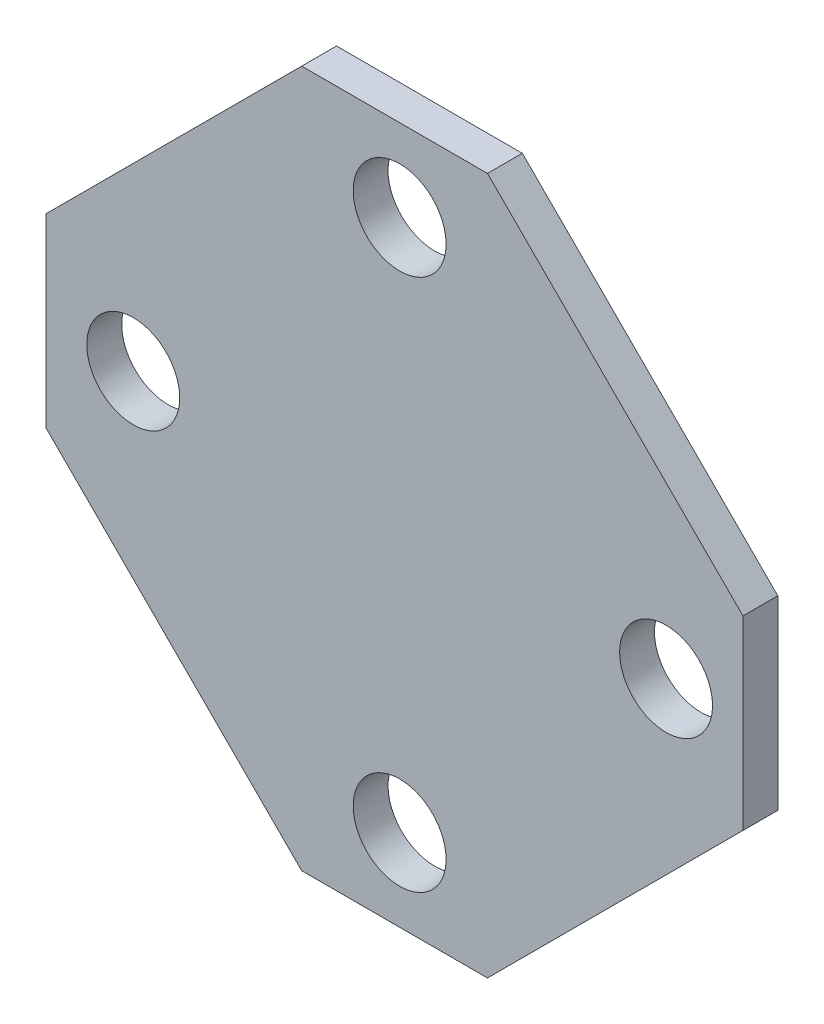
ISO-10303-21;
HEADER;
FILE_DESCRIPTION(('STEP AP214'),'2;1');
FILE_NAME('part.step','',(''),(''),'','','');
FILE_SCHEMA(('AUTOMOTIVE_DESIGN { 1 0 10303 214 1 1 1 1 }'));
ENDSEC;
DATA;
#1=APPLICATION_CONTEXT('core data for automotive mechanical design processes');
#2=APPLICATION_PROTOCOL_DEFINITION('international standard','automotive_design',2000,#1);
#3=PRODUCT_CONTEXT('',#1,'mechanical');
#4=PRODUCT('Part','Part','',(#3));
#5=PRODUCT_RELATED_PRODUCT_CATEGORY('part','',(#4));
#6=PRODUCT_DEFINITION_FORMATION('','',#4);
#7=PRODUCT_DEFINITION_CONTEXT('part definition',#1,'design');
#8=PRODUCT_DEFINITION('design','',#6,#7);
#9=PRODUCT_DEFINITION_SHAPE('','',#8);
#10=(LENGTH_UNIT() NAMED_UNIT(*) SI_UNIT(.MILLI.,.METRE.));
#11=(NAMED_UNIT(*) PLANE_ANGLE_UNIT() SI_UNIT($,.RADIAN.));
#12=(NAMED_UNIT(*) SI_UNIT($,.STERADIAN.) SOLID_ANGLE_UNIT());
#13=UNCERTAINTY_MEASURE_WITH_UNIT(LENGTH_MEASURE(1.E-05),#10,'distance_accuracy_value','');
#14=(GEOMETRIC_REPRESENTATION_CONTEXT(3) GLOBAL_UNCERTAINTY_ASSIGNED_CONTEXT((#13)) GLOBAL_UNIT_ASSIGNED_CONTEXT((#10,
#11,#12)) REPRESENTATION_CONTEXT('',''));
#15=CARTESIAN_POINT('',(0.,0.,0.));
#16=DIRECTION('',(0.,0.,1.));
#17=DIRECTION('',(1.,0.,0.));
#18=AXIS2_PLACEMENT_3D('',#15,#16,#17);
#19=CARTESIAN_POINT('',(8.00000000000001,30.,3.));
#20=DIRECTION('',(0.,-1.,0.));
#21=DIRECTION('',(0.,0.,-1.));
#22=AXIS2_PLACEMENT_3D('',#19,#20,#21);
#23=PLANE('',#22);
#24=DIRECTION('',(-1.,0.,0.));
#25=VECTOR('',#24,1.);
#26=CARTESIAN_POINT('',(8.00000000000001,30.,0.));
#27=LINE('',#26,#25);
#28=CARTESIAN_POINT('',(8.00000000000001,30.,0.));
#29=VERTEX_POINT('',#28);
#30=CARTESIAN_POINT('',(-7.99999999999999,30.,0.));
#31=VERTEX_POINT('',#30);
#32=EDGE_CURVE('E134',#29,#31,#27,.T.);
#33=ORIENTED_EDGE('',*,*,#32,.T.);
#34=DIRECTION('',(0.,0.,-1.));
#35=VECTOR('',#34,1.);
#36=CARTESIAN_POINT('',(-7.99999999999999,30.,3.));
#37=LINE('',#36,#35);
#38=CARTESIAN_POINT('',(-7.99999999999999,30.,3.));
#39=VERTEX_POINT('',#38);
#40=EDGE_CURVE('E11',#39,#31,#37,.T.);
#41=ORIENTED_EDGE('',*,*,#40,.F.);
#42=DIRECTION('',(-1.,0.,0.));
#43=VECTOR('',#42,1.);
#44=CARTESIAN_POINT('',(8.00000000000001,30.,3.));
#45=LINE('',#44,#43);
#46=CARTESIAN_POINT('',(8.00000000000001,30.,3.));
#47=VERTEX_POINT('',#46);
#48=EDGE_CURVE('E153',#47,#39,#45,.T.);
#49=ORIENTED_EDGE('',*,*,#48,.F.);
#50=DIRECTION('',(0.,0.,-1.));
#51=VECTOR('',#50,1.);
#52=CARTESIAN_POINT('',(8.00000000000001,30.,3.));
#53=LINE('',#52,#51);
#54=EDGE_CURVE('E130',#47,#29,#53,.T.);
#55=ORIENTED_EDGE('',*,*,#54,.T.);
#56=EDGE_LOOP('',(#33,#41,#49,#55));
#57=FACE_BOUND('',#56,.T.);
#58=ADVANCED_FACE('F38',(#57),#23,.F.);
#59=CARTESIAN_POINT('',(-7.99999999999999,30.,3.));
#60=DIRECTION('',(0.707106781186548,-0.707106781186547,0.));
#61=DIRECTION('',(0.707106781186547,0.707106781186548,0.));
#62=AXIS2_PLACEMENT_3D('',#59,#60,#61);
#63=PLANE('',#62);
#64=DIRECTION('',(-0.707106781186547,-0.707106781186548,0.));
#65=VECTOR('',#64,1.);
#66=CARTESIAN_POINT('',(-7.99999999999999,30.,0.));
#67=LINE('',#66,#65);
#68=CARTESIAN_POINT('',(-30.,7.99999999999999,0.));
#69=VERTEX_POINT('',#68);
#70=EDGE_CURVE('E137',#31,#69,#67,.T.);
#71=ORIENTED_EDGE('',*,*,#70,.T.);
#72=DIRECTION('',(0.,0.,-1.));
#73=VECTOR('',#72,1.);
#74=CARTESIAN_POINT('',(-30.,7.99999999999999,3.));
#75=LINE('',#74,#73);
#76=CARTESIAN_POINT('',(-30.,7.99999999999999,3.));
#77=VERTEX_POINT('',#76);
#78=EDGE_CURVE('E46',#77,#69,#75,.T.);
#79=ORIENTED_EDGE('',*,*,#78,.F.);
#80=DIRECTION('',(-0.707106781186547,-0.707106781186548,0.));
#81=VECTOR('',#80,1.);
#82=CARTESIAN_POINT('',(-7.99999999999999,30.,3.));
#83=LINE('',#82,#81);
#84=EDGE_CURVE('E97',#39,#77,#83,.T.);
#85=ORIENTED_EDGE('',*,*,#84,.F.);
#86=ORIENTED_EDGE('',*,*,#40,.T.);
#87=EDGE_LOOP('',(#71,#79,#85,#86));
#88=FACE_BOUND('',#87,.T.);
#89=ADVANCED_FACE('F166',(#88),#63,.F.);
#90=CARTESIAN_POINT('',(-30.,-8.00000000000001,3.));
#91=DIRECTION('',(-1.,0.,0.));
#92=DIRECTION('',(0.,0.,1.));
#93=AXIS2_PLACEMENT_3D('',#90,#91,#92);
#94=PLANE('',#93);
#95=DIRECTION('',(0.,1.,0.));
#96=VECTOR('',#95,1.);
#97=CARTESIAN_POINT('',(-30.,-8.00000000000001,0.));
#98=LINE('',#97,#96);
#99=CARTESIAN_POINT('',(-30.,-8.00000000000001,0.));
#100=VERTEX_POINT('',#99);
#101=EDGE_CURVE('E141',#100,#69,#98,.T.);
#102=ORIENTED_EDGE('',*,*,#101,.F.);
#103=DIRECTION('',(0.,0.,-1.));
#104=VECTOR('',#103,1.);
#105=CARTESIAN_POINT('',(-30.,-8.00000000000001,3.));
#106=LINE('',#105,#104);
#107=CARTESIAN_POINT('',(-30.,-8.00000000000001,3.));
#108=VERTEX_POINT('',#107);
#109=EDGE_CURVE('E159',#108,#100,#106,.T.);
#110=ORIENTED_EDGE('',*,*,#109,.F.);
#111=DIRECTION('',(0.,1.,0.));
#112=VECTOR('',#111,1.);
#113=CARTESIAN_POINT('',(-30.,-8.00000000000001,3.));
#114=LINE('',#113,#112);
#115=EDGE_CURVE('E165',#108,#77,#114,.T.);
#116=ORIENTED_EDGE('',*,*,#115,.T.);
#117=ORIENTED_EDGE('',*,*,#78,.T.);
#118=EDGE_LOOP('',(#102,#110,#116,#117));
#119=FACE_BOUND('',#118,.T.);
#120=ADVANCED_FACE('F163',(#119),#94,.T.);
#121=CARTESIAN_POINT('',(-7.99999999999999,-30.,3.));
#122=DIRECTION('',(-0.707106781186547,-0.707106781186548,0.));
#123=DIRECTION('',(0.707106781186548,-0.707106781186547,0.));
#124=AXIS2_PLACEMENT_3D('',#121,#122,#123);
#125=PLANE('',#124);
#126=DIRECTION('',(-0.707106781186548,0.707106781186547,0.));
#127=VECTOR('',#126,1.);
#128=CARTESIAN_POINT('',(-7.99999999999999,-30.,0.));
#129=LINE('',#128,#127);
#130=CARTESIAN_POINT('',(-7.99999999999999,-30.,0.));
#131=VERTEX_POINT('',#130);
#132=EDGE_CURVE('E144',#131,#100,#129,.T.);
#133=ORIENTED_EDGE('',*,*,#132,.F.);
#134=DIRECTION('',(0.,0.,-1.));
#135=VECTOR('',#134,1.);
#136=CARTESIAN_POINT('',(-7.99999999999999,-30.,3.));
#137=LINE('',#136,#135);
#138=CARTESIAN_POINT('',(-7.99999999999999,-30.,3.));
#139=VERTEX_POINT('',#138);
#140=EDGE_CURVE('E157',#139,#131,#137,.T.);
#141=ORIENTED_EDGE('',*,*,#140,.F.);
#142=DIRECTION('',(-0.707106781186548,0.707106781186547,0.));
#143=VECTOR('',#142,1.);
#144=CARTESIAN_POINT('',(-7.99999999999999,-30.,3.));
#145=LINE('',#144,#143);
#146=EDGE_CURVE('E176',#139,#108,#145,.T.);
#147=ORIENTED_EDGE('',*,*,#146,.T.);
#148=ORIENTED_EDGE('',*,*,#109,.T.);
#149=EDGE_LOOP('',(#133,#141,#147,#148));
#150=FACE_BOUND('',#149,.T.);
#151=ADVANCED_FACE('F174',(#150),#125,.T.);
#152=CARTESIAN_POINT('',(8.00000000000001,-30.,3.));
#153=DIRECTION('',(0.,-1.,0.));
#154=DIRECTION('',(0.,0.,-1.));
#155=AXIS2_PLACEMENT_3D('',#152,#153,#154);
#156=PLANE('',#155);
#157=DIRECTION('',(-1.,0.,0.));
#158=VECTOR('',#157,1.);
#159=CARTESIAN_POINT('',(8.00000000000001,-30.,0.));
#160=LINE('',#159,#158);
#161=CARTESIAN_POINT('',(8.00000000000001,-30.,0.));
#162=VERTEX_POINT('',#161);
#163=EDGE_CURVE('E147',#162,#131,#160,.T.);
#164=ORIENTED_EDGE('',*,*,#163,.F.);
#165=DIRECTION('',(0.,0.,-1.));
#166=VECTOR('',#165,1.);
#167=CARTESIAN_POINT('',(8.00000000000001,-30.,3.));
#168=LINE('',#167,#166);
#169=CARTESIAN_POINT('',(8.00000000000001,-30.,3.));
#170=VERTEX_POINT('',#169);
#171=EDGE_CURVE('E125',#170,#162,#168,.T.);
#172=ORIENTED_EDGE('',*,*,#171,.F.);
#173=DIRECTION('',(-1.,0.,0.));
#174=VECTOR('',#173,1.);
#175=CARTESIAN_POINT('',(8.00000000000001,-30.,3.));
#176=LINE('',#175,#174);
#177=EDGE_CURVE('E118',#170,#139,#176,.T.);
#178=ORIENTED_EDGE('',*,*,#177,.T.);
#179=ORIENTED_EDGE('',*,*,#140,.T.);
#180=EDGE_LOOP('',(#164,#172,#178,#179));
#181=FACE_BOUND('',#180,.T.);
#182=ADVANCED_FACE('F182',(#181),#156,.T.);
#183=CARTESIAN_POINT('',(8.00000000000001,-30.,3.));
#184=DIRECTION('',(-0.707106781186548,0.707106781186547,0.));
#185=DIRECTION('',(-0.707106781186547,-0.707106781186548,0.));
#186=AXIS2_PLACEMENT_3D('',#183,#184,#185);
#187=PLANE('',#186);
#188=DIRECTION('',(0.707106781186547,0.707106781186548,0.));
#189=VECTOR('',#188,1.);
#190=CARTESIAN_POINT('',(8.00000000000001,-30.,0.));
#191=LINE('',#190,#189);
#192=CARTESIAN_POINT('',(30.,-8.,0.));
#193=VERTEX_POINT('',#192);
#194=EDGE_CURVE('E124',#162,#193,#191,.T.);
#195=ORIENTED_EDGE('',*,*,#194,.T.);
#196=DIRECTION('',(0.,0.,-1.));
#197=VECTOR('',#196,1.);
#198=CARTESIAN_POINT('',(30.,-8.,3.));
#199=LINE('',#198,#197);
#200=CARTESIAN_POINT('',(30.,-8.,3.));
#201=VERTEX_POINT('',#200);
#202=EDGE_CURVE('E121',#201,#193,#199,.T.);
#203=ORIENTED_EDGE('',*,*,#202,.F.);
#204=DIRECTION('',(0.707106781186547,0.707106781186548,0.));
#205=VECTOR('',#204,1.);
#206=CARTESIAN_POINT('',(8.00000000000001,-30.,3.));
#207=LINE('',#206,#205);
#208=EDGE_CURVE('E111',#170,#201,#207,.T.);
#209=ORIENTED_EDGE('',*,*,#208,.F.);
#210=ORIENTED_EDGE('',*,*,#171,.T.);
#211=EDGE_LOOP('',(#195,#203,#209,#210));
#212=FACE_BOUND('',#211,.T.);
#213=ADVANCED_FACE('F122',(#212),#187,.F.);
#214=CARTESIAN_POINT('',(30.,-8.,3.));
#215=DIRECTION('',(-1.,0.,0.));
#216=DIRECTION('',(0.,0.,1.));
#217=AXIS2_PLACEMENT_3D('',#214,#215,#216);
#218=PLANE('',#217);
#219=DIRECTION('',(0.,1.,0.));
#220=VECTOR('',#219,1.);
#221=CARTESIAN_POINT('',(30.,-8.,0.));
#222=LINE('',#221,#220);
#223=CARTESIAN_POINT('',(30.,8.,0.));
#224=VERTEX_POINT('',#223);
#225=EDGE_CURVE('E83',#193,#224,#222,.T.);
#226=ORIENTED_EDGE('',*,*,#225,.T.);
#227=DIRECTION('',(0.,0.,-1.));
#228=VECTOR('',#227,1.);
#229=CARTESIAN_POINT('',(30.,8.,3.));
#230=LINE('',#229,#228);
#231=CARTESIAN_POINT('',(30.,8.,3.));
#232=VERTEX_POINT('',#231);
#233=EDGE_CURVE('E126',#232,#224,#230,.T.);
#234=ORIENTED_EDGE('',*,*,#233,.F.);
#235=DIRECTION('',(0.,1.,0.));
#236=VECTOR('',#235,1.);
#237=CARTESIAN_POINT('',(30.,-8.,3.));
#238=LINE('',#237,#236);
#239=EDGE_CURVE('E115',#201,#232,#238,.T.);
#240=ORIENTED_EDGE('',*,*,#239,.F.);
#241=ORIENTED_EDGE('',*,*,#202,.T.);
#242=EDGE_LOOP('',(#226,#234,#240,#241));
#243=FACE_BOUND('',#242,.T.);
#244=ADVANCED_FACE('F128',(#243),#218,.F.);
#245=CARTESIAN_POINT('',(30.,8.,3.));
#246=DIRECTION('',(-0.707106781186547,-0.707106781186548,0.));
#247=DIRECTION('',(0.707106781186548,-0.707106781186547,0.));
#248=AXIS2_PLACEMENT_3D('',#245,#246,#247);
#249=PLANE('',#248);
#250=DIRECTION('',(-0.707106781186548,0.707106781186547,0.));
#251=VECTOR('',#250,1.);
#252=CARTESIAN_POINT('',(30.,8.,0.));
#253=LINE('',#252,#251);
#254=EDGE_CURVE('E89',#224,#29,#253,.T.);
#255=ORIENTED_EDGE('',*,*,#254,.T.);
#256=ORIENTED_EDGE('',*,*,#54,.F.);
#257=DIRECTION('',(-0.707106781186548,0.707106781186547,0.));
#258=VECTOR('',#257,1.);
#259=CARTESIAN_POINT('',(30.,8.,3.));
#260=LINE('',#259,#258);
#261=EDGE_CURVE('E54',#232,#47,#260,.T.);
#262=ORIENTED_EDGE('',*,*,#261,.F.);
#263=ORIENTED_EDGE('',*,*,#233,.T.);
#264=EDGE_LOOP('',(#255,#256,#262,#263));
#265=FACE_BOUND('',#264,.T.);
#266=ADVANCED_FACE('F185',(#265),#249,.F.);
#267=CARTESIAN_POINT('',(0.,0.,3.));
#268=DIRECTION('',(0.,0.,-1.));
#269=DIRECTION('',(-1.,0.,0.));
#270=AXIS2_PLACEMENT_3D('',#267,#268,#269);
#271=PLANE('',#270);
#272=CARTESIAN_POINT('',(0.438067255795555,-22.9380672557955,3.));
#273=DIRECTION('',(0.,0.,1.));
#274=DIRECTION('',(0.,1.,0.));
#275=AXIS2_PLACEMENT_3D('',#272,#273,#274);
#276=CIRCLE('',#275,4.);
#277=CARTESIAN_POINT('',(0.438067255795541,-18.9380672557955,3.));
#278=VERTEX_POINT('',#277);
#279=EDGE_CURVE('E283',#278,#278,#276,.T.);
#280=ORIENTED_EDGE('',*,*,#279,.F.);
#281=EDGE_LOOP('',(#280));
#282=FACE_BOUND('',#281,.T.);
#283=CARTESIAN_POINT('',(23.376134511591,0.,3.));
#284=DIRECTION('',(0.,0.,1.));
#285=DIRECTION('',(-1.,0.,0.));
#286=AXIS2_PLACEMENT_3D('',#283,#284,#285);
#287=CIRCLE('',#286,4.);
#288=CARTESIAN_POINT('',(19.376134511591,0.,3.));
#289=VERTEX_POINT('',#288);
#290=EDGE_CURVE('E287',#289,#289,#287,.T.);
#291=ORIENTED_EDGE('',*,*,#290,.F.);
#292=EDGE_LOOP('',(#291));
#293=FACE_BOUND('',#292,.T.);
#294=CARTESIAN_POINT('',(0.438067255795243,22.9380672557955,3.));
#295=DIRECTION('',(0.,0.,1.));
#296=DIRECTION('',(0.,-1.,0.));
#297=AXIS2_PLACEMENT_3D('',#294,#295,#296);
#298=CIRCLE('',#297,4.);
#299=CARTESIAN_POINT('',(0.438067255795285,18.9380672557955,3.));
#300=VERTEX_POINT('',#299);
#301=EDGE_CURVE('E297',#300,#300,#298,.T.);
#302=ORIENTED_EDGE('',*,*,#301,.F.);
#303=EDGE_LOOP('',(#302));
#304=FACE_BOUND('',#303,.T.);
#305=CARTESIAN_POINT('',(-22.5,0.,3.));
#306=DIRECTION('',(0.,0.,1.));
#307=DIRECTION('',(1.,0.,0.));
#308=AXIS2_PLACEMENT_3D('',#305,#306,#307);
#309=CIRCLE('',#308,4.);
#310=CARTESIAN_POINT('',(-18.5,0.,3.));
#311=VERTEX_POINT('',#310);
#312=EDGE_CURVE('E138',#311,#311,#309,.T.);
#313=ORIENTED_EDGE('',*,*,#312,.F.);
#314=EDGE_LOOP('',(#313));
#315=FACE_BOUND('',#314,.T.);
#316=ORIENTED_EDGE('',*,*,#48,.T.);
#317=ORIENTED_EDGE('',*,*,#84,.T.);
#318=ORIENTED_EDGE('',*,*,#115,.F.);
#319=ORIENTED_EDGE('',*,*,#146,.F.);
#320=ORIENTED_EDGE('',*,*,#177,.F.);
#321=ORIENTED_EDGE('',*,*,#208,.T.);
#322=ORIENTED_EDGE('',*,*,#239,.T.);
#323=ORIENTED_EDGE('',*,*,#261,.T.);
#324=EDGE_LOOP('',(#316,#317,#318,#319,#320,#321,#322,#323));
#325=FACE_BOUND('',#324,.T.);
#326=ADVANCED_FACE('F113',(#282,#293,#304,#315,#325),#271,.F.);
#327=CARTESIAN_POINT('',(0.,0.,0.));
#328=DIRECTION('',(0.,0.,-1.));
#329=DIRECTION('',(-1.,0.,0.));
#330=AXIS2_PLACEMENT_3D('',#327,#328,#329);
#331=PLANE('',#330);
#332=CARTESIAN_POINT('',(0.438067255795555,-22.9380672557955,0.));
#333=DIRECTION('',(0.,0.,1.));
#334=DIRECTION('',(0.,1.,0.));
#335=AXIS2_PLACEMENT_3D('',#332,#333,#334);
#336=CIRCLE('',#335,4.);
#337=CARTESIAN_POINT('',(0.438067255795541,-18.9380672557955,0.));
#338=VERTEX_POINT('',#337);
#339=EDGE_CURVE('E286',#338,#338,#336,.T.);
#340=ORIENTED_EDGE('',*,*,#339,.T.);
#341=EDGE_LOOP('',(#340));
#342=FACE_BOUND('',#341,.T.);
#343=CARTESIAN_POINT('',(23.376134511591,0.,0.));
#344=DIRECTION('',(0.,0.,1.));
#345=DIRECTION('',(-1.,0.,0.));
#346=AXIS2_PLACEMENT_3D('',#343,#344,#345);
#347=CIRCLE('',#346,4.);
#348=CARTESIAN_POINT('',(19.376134511591,0.,0.));
#349=VERTEX_POINT('',#348);
#350=EDGE_CURVE('E292',#349,#349,#347,.T.);
#351=ORIENTED_EDGE('',*,*,#350,.T.);
#352=EDGE_LOOP('',(#351));
#353=FACE_BOUND('',#352,.T.);
#354=CARTESIAN_POINT('',(0.438067255795243,22.9380672557955,0.));
#355=DIRECTION('',(0.,0.,1.));
#356=DIRECTION('',(0.,-1.,0.));
#357=AXIS2_PLACEMENT_3D('',#354,#355,#356);
#358=CIRCLE('',#357,4.);
#359=CARTESIAN_POINT('',(0.438067255795285,18.9380672557955,0.));
#360=VERTEX_POINT('',#359);
#361=EDGE_CURVE('E300',#360,#360,#358,.T.);
#362=ORIENTED_EDGE('',*,*,#361,.T.);
#363=EDGE_LOOP('',(#362));
#364=FACE_BOUND('',#363,.T.);
#365=CARTESIAN_POINT('',(-22.5,0.,0.));
#366=DIRECTION('',(0.,0.,1.));
#367=DIRECTION('',(1.,0.,0.));
#368=AXIS2_PLACEMENT_3D('',#365,#366,#367);
#369=CIRCLE('',#368,4.);
#370=CARTESIAN_POINT('',(-18.5,0.,0.));
#371=VERTEX_POINT('',#370);
#372=EDGE_CURVE('E289',#371,#371,#369,.T.);
#373=ORIENTED_EDGE('',*,*,#372,.T.);
#374=EDGE_LOOP('',(#373));
#375=FACE_BOUND('',#374,.T.);
#376=ORIENTED_EDGE('',*,*,#32,.F.);
#377=ORIENTED_EDGE('',*,*,#254,.F.);
#378=ORIENTED_EDGE('',*,*,#225,.F.);
#379=ORIENTED_EDGE('',*,*,#194,.F.);
#380=ORIENTED_EDGE('',*,*,#163,.T.);
#381=ORIENTED_EDGE('',*,*,#132,.T.);
#382=ORIENTED_EDGE('',*,*,#101,.T.);
#383=ORIENTED_EDGE('',*,*,#70,.F.);
#384=EDGE_LOOP('',(#376,#377,#378,#379,#380,#381,#382,#383));
#385=FACE_BOUND('',#384,.T.);
#386=ADVANCED_FACE('F170',(#342,#353,#364,#375,#385),#331,.T.);
#387=CARTESIAN_POINT('',(-22.5,0.,3.));
#388=DIRECTION('',(0.,0.,-1.));
#389=DIRECTION('',(-1.,0.,0.));
#390=AXIS2_PLACEMENT_3D('',#387,#388,#389);
#391=CYLINDRICAL_SURFACE('',#390,4.);
#392=ORIENTED_EDGE('',*,*,#312,.T.);
#393=EDGE_LOOP('',(#392));
#394=FACE_BOUND('',#393,.T.);
#395=ORIENTED_EDGE('',*,*,#372,.F.);
#396=EDGE_LOOP('',(#395));
#397=FACE_BOUND('',#396,.T.);
#398=ADVANCED_FACE('F228',(#394,#397),#391,.F.);
#399=CARTESIAN_POINT('',(0.438067255795243,22.9380672557955,3.));
#400=DIRECTION('',(0.,0.,-1.));
#401=DIRECTION('',(-1.,0.,0.));
#402=AXIS2_PLACEMENT_3D('',#399,#400,#401);
#403=CYLINDRICAL_SURFACE('',#402,4.);
#404=ORIENTED_EDGE('',*,*,#301,.T.);
#405=EDGE_LOOP('',(#404));
#406=FACE_BOUND('',#405,.T.);
#407=ORIENTED_EDGE('',*,*,#361,.F.);
#408=EDGE_LOOP('',(#407));
#409=FACE_BOUND('',#408,.T.);
#410=ADVANCED_FACE('F233',(#406,#409),#403,.F.);
#411=CARTESIAN_POINT('',(23.376134511591,0.,3.));
#412=DIRECTION('',(0.,0.,-1.));
#413=DIRECTION('',(-1.,0.,0.));
#414=AXIS2_PLACEMENT_3D('',#411,#412,#413);
#415=CYLINDRICAL_SURFACE('',#414,4.);
#416=ORIENTED_EDGE('',*,*,#290,.T.);
#417=EDGE_LOOP('',(#416));
#418=FACE_BOUND('',#417,.T.);
#419=ORIENTED_EDGE('',*,*,#350,.F.);
#420=EDGE_LOOP('',(#419));
#421=FACE_BOUND('',#420,.T.);
#422=ADVANCED_FACE('F256',(#418,#421),#415,.F.);
#423=CARTESIAN_POINT('',(0.438067255795555,-22.9380672557955,3.));
#424=DIRECTION('',(0.,0.,-1.));
#425=DIRECTION('',(-1.,0.,0.));
#426=AXIS2_PLACEMENT_3D('',#423,#424,#425);
#427=CYLINDRICAL_SURFACE('',#426,4.);
#428=ORIENTED_EDGE('',*,*,#279,.T.);
#429=EDGE_LOOP('',(#428));
#430=FACE_BOUND('',#429,.T.);
#431=ORIENTED_EDGE('',*,*,#339,.F.);
#432=EDGE_LOOP('',(#431));
#433=FACE_BOUND('',#432,.T.);
#434=ADVANCED_FACE('F266',(#430,#433),#427,.F.);
#435=CLOSED_SHELL('',(#58,#89,#120,#151,#182,#213,#244,#266,#326,#386,#398,#410,#422,#434));
#436=MANIFOLD_SOLID_BREP('B2',#435);
#437=ADVANCED_BREP_SHAPE_REPRESENTATION('',(#18,#436),#14);
#438=SHAPE_DEFINITION_REPRESENTATION(#9,#437);
ENDSEC;
END-ISO-10303-21;
